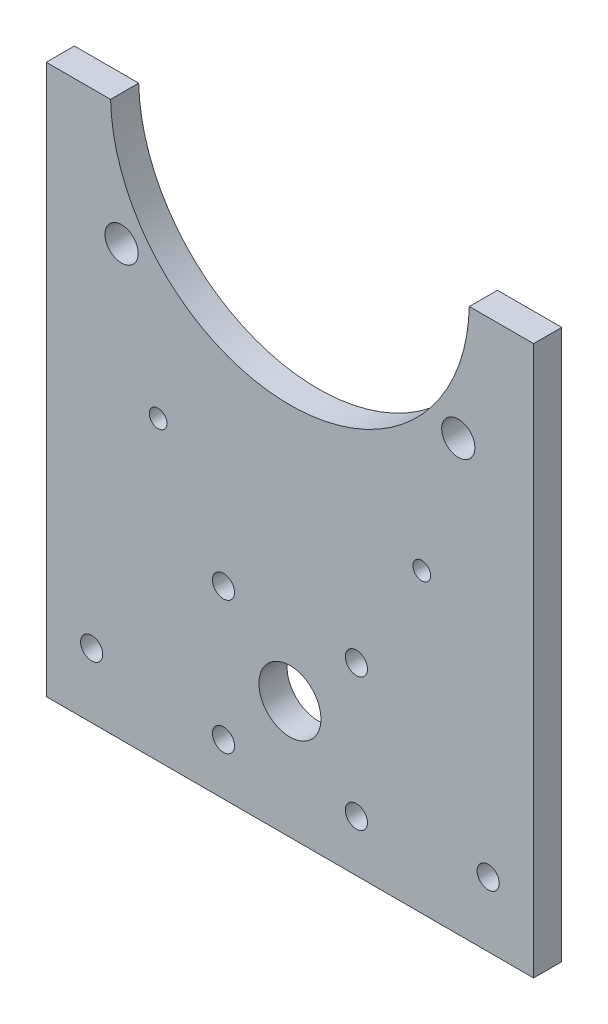
ISO-10303-21;
HEADER;
FILE_DESCRIPTION(('STEP AP214'),'2;1');
FILE_NAME('part.step','',(''),(''),'','','');
FILE_SCHEMA(('AUTOMOTIVE_DESIGN { 1 0 10303 214 1 1 1 1 }'));
ENDSEC;
DATA;
#1=APPLICATION_CONTEXT('core data for automotive mechanical design processes');
#2=APPLICATION_PROTOCOL_DEFINITION('international standard','automotive_design',2000,#1);
#3=PRODUCT_CONTEXT('',#1,'mechanical');
#4=PRODUCT('Part','Part','',(#3));
#5=PRODUCT_RELATED_PRODUCT_CATEGORY('part','',(#4));
#6=PRODUCT_DEFINITION_FORMATION('','',#4);
#7=PRODUCT_DEFINITION_CONTEXT('part definition',#1,'design');
#8=PRODUCT_DEFINITION('design','',#6,#7);
#9=PRODUCT_DEFINITION_SHAPE('','',#8);
#10=(LENGTH_UNIT() NAMED_UNIT(*) SI_UNIT(.MILLI.,.METRE.));
#11=(NAMED_UNIT(*) PLANE_ANGLE_UNIT() SI_UNIT($,.RADIAN.));
#12=(NAMED_UNIT(*) SI_UNIT($,.STERADIAN.) SOLID_ANGLE_UNIT());
#13=UNCERTAINTY_MEASURE_WITH_UNIT(LENGTH_MEASURE(1.E-05),#10,'distance_accuracy_value','');
#14=(GEOMETRIC_REPRESENTATION_CONTEXT(3) GLOBAL_UNCERTAINTY_ASSIGNED_CONTEXT((#13)) GLOBAL_UNIT_ASSIGNED_CONTEXT((#10,
#11,#12)) REPRESENTATION_CONTEXT('',''));
#15=CARTESIAN_POINT('',(0.,0.,0.));
#16=DIRECTION('',(0.,0.,1.));
#17=DIRECTION('',(1.,0.,0.));
#18=AXIS2_PLACEMENT_3D('',#15,#16,#17);
#19=CARTESIAN_POINT('',(-55.,125.,6.35));
#20=DIRECTION('',(0.,0.,1.));
#21=DIRECTION('',(1.,0.,0.));
#22=AXIS2_PLACEMENT_3D('',#19,#20,#21);
#23=PLANE('',#22);
#24=CARTESIAN_POINT('',(-40.,41.6010141988433,6.35));
#25=DIRECTION('',(0.,0.,1.));
#26=DIRECTION('',(1.,0.,0.));
#27=AXIS2_PLACEMENT_3D('',#24,#25,#26);
#28=CIRCLE('',#27,2.5);
#29=CARTESIAN_POINT('',(-37.5,41.6010141988433,6.35));
#30=VERTEX_POINT('',#29);
#31=EDGE_CURVE('E288',#30,#30,#28,.T.);
#32=ORIENTED_EDGE('',*,*,#31,.F.);
#33=EDGE_LOOP('',(#32));
#34=FACE_BOUND('',#33,.T.);
#35=CARTESIAN_POINT('',(-70.,41.6010141988433,6.35));
#36=DIRECTION('',(0.,0.,1.));
#37=DIRECTION('',(1.,0.,0.));
#38=AXIS2_PLACEMENT_3D('',#35,#36,#37);
#39=CIRCLE('',#38,2.50000000000001);
#40=CARTESIAN_POINT('',(-67.5,41.6010141988433,6.35));
#41=VERTEX_POINT('',#40);
#42=EDGE_CURVE('E283',#41,#41,#39,.T.);
#43=ORIENTED_EDGE('',*,*,#42,.F.);
#44=EDGE_LOOP('',(#43));
#45=FACE_BOUND('',#44,.T.);
#46=CARTESIAN_POINT('',(-70.,11.6010141988433,6.35));
#47=DIRECTION('',(0.,0.,1.));
#48=DIRECTION('',(1.,0.,0.));
#49=AXIS2_PLACEMENT_3D('',#46,#47,#48);
#50=CIRCLE('',#49,2.5);
#51=CARTESIAN_POINT('',(-67.5,11.6010141988433,6.35));
#52=VERTEX_POINT('',#51);
#53=EDGE_CURVE('E279',#52,#52,#50,.T.);
#54=ORIENTED_EDGE('',*,*,#53,.F.);
#55=EDGE_LOOP('',(#54));
#56=FACE_BOUND('',#55,.T.);
#57=CARTESIAN_POINT('',(-40.,11.6010141988433,6.35));
#58=DIRECTION('',(0.,0.,1.));
#59=DIRECTION('',(1.,0.,0.));
#60=AXIS2_PLACEMENT_3D('',#57,#58,#59);
#61=CIRCLE('',#60,2.5);
#62=CARTESIAN_POINT('',(-37.5,11.6010141988433,6.35));
#63=VERTEX_POINT('',#62);
#64=EDGE_CURVE('E272',#63,#63,#61,.T.);
#65=ORIENTED_EDGE('',*,*,#64,.F.);
#66=EDGE_LOOP('',(#65));
#67=FACE_BOUND('',#66,.T.);
#68=CARTESIAN_POINT('',(-55.,26.6010141988433,6.35));
#69=DIRECTION('',(0.,0.,1.));
#70=DIRECTION('',(1.,0.,0.));
#71=AXIS2_PLACEMENT_3D('',#68,#69,#70);
#72=CIRCLE('',#71,7.);
#73=CARTESIAN_POINT('',(-48.,26.6010141988433,6.35));
#74=VERTEX_POINT('',#73);
#75=EDGE_CURVE('E144',#74,#74,#72,.T.);
#76=ORIENTED_EDGE('',*,*,#75,.F.);
#77=EDGE_LOOP('',(#76));
#78=FACE_BOUND('',#77,.T.);
#79=CARTESIAN_POINT('',(-99.75,14.6010141988433,6.35));
#80=DIRECTION('',(0.,0.,1.));
#81=DIRECTION('',(1.,0.,0.));
#82=AXIS2_PLACEMENT_3D('',#79,#80,#81);
#83=CIRCLE('',#82,2.5);
#84=CARTESIAN_POINT('',(-97.25,14.6010141988433,6.35));
#85=VERTEX_POINT('',#84);
#86=EDGE_CURVE('E167',#85,#85,#83,.T.);
#87=ORIENTED_EDGE('',*,*,#86,.F.);
#88=EDGE_LOOP('',(#87));
#89=FACE_BOUND('',#88,.T.);
#90=CARTESIAN_POINT('',(-17.,97.,6.35));
#91=DIRECTION('',(0.,0.,1.));
#92=DIRECTION('',(-1.,0.,0.));
#93=AXIS2_PLACEMENT_3D('',#90,#91,#92);
#94=CIRCLE('',#93,3.75000000000001);
#95=CARTESIAN_POINT('',(-20.75,97.,6.35));
#96=VERTEX_POINT('',#95);
#97=EDGE_CURVE('E179',#96,#96,#94,.T.);
#98=ORIENTED_EDGE('',*,*,#97,.F.);
#99=EDGE_LOOP('',(#98));
#100=FACE_BOUND('',#99,.T.);
#101=CARTESIAN_POINT('',(-25.25,67.,6.35));
#102=DIRECTION('',(0.,0.,1.));
#103=DIRECTION('',(-1.,0.,0.));
#104=AXIS2_PLACEMENT_3D('',#101,#102,#103);
#105=CIRCLE('',#104,2.);
#106=CARTESIAN_POINT('',(-27.25,67.,6.35));
#107=VERTEX_POINT('',#106);
#108=EDGE_CURVE('E127',#107,#107,#105,.T.);
#109=ORIENTED_EDGE('',*,*,#108,.F.);
#110=EDGE_LOOP('',(#109));
#111=FACE_BOUND('',#110,.T.);
#112=DIRECTION('',(0.,1.,0.));
#113=VECTOR('',#112,1.);
#114=CARTESIAN_POINT('',(0.,0.,6.35));
#115=LINE('',#114,#113);
#116=CARTESIAN_POINT('',(0.,0.,6.35));
#117=VERTEX_POINT('',#116);
#118=CARTESIAN_POINT('',(0.,124.,6.35));
#119=VERTEX_POINT('',#118);
#120=EDGE_CURVE('E134',#117,#119,#115,.T.);
#121=ORIENTED_EDGE('',*,*,#120,.T.);
#122=DIRECTION('',(-1.,0.,0.));
#123=VECTOR('',#122,1.);
#124=CARTESIAN_POINT('',(0.,124.,6.35));
#125=LINE('',#124,#123);
#126=CARTESIAN_POINT('',(-14.5123475612626,124.,6.35));
#127=VERTEX_POINT('',#126);
#128=EDGE_CURVE('E92',#119,#127,#125,.T.);
#129=ORIENTED_EDGE('',*,*,#128,.T.);
#130=CARTESIAN_POINT('',(-55.,125.,6.35));
#131=DIRECTION('',(0.,0.,-1.));
#132=DIRECTION('',(1.,0.,0.));
#133=AXIS2_PLACEMENT_3D('',#130,#131,#132);
#134=CIRCLE('',#133,40.5);
#135=CARTESIAN_POINT('',(-95.4876524387374,124.,6.35));
#136=VERTEX_POINT('',#135);
#137=EDGE_CURVE('E105',#127,#136,#134,.T.);
#138=ORIENTED_EDGE('',*,*,#137,.T.);
#139=DIRECTION('',(-1.,0.,0.));
#140=VECTOR('',#139,1.);
#141=CARTESIAN_POINT('',(-110.,124.,6.35));
#142=LINE('',#141,#140);
#143=CARTESIAN_POINT('',(-110.,124.,6.35));
#144=VERTEX_POINT('',#143);
#145=EDGE_CURVE('E99',#136,#144,#142,.T.);
#146=ORIENTED_EDGE('',*,*,#145,.T.);
#147=DIRECTION('',(0.,-1.,0.));
#148=VECTOR('',#147,1.);
#149=CARTESIAN_POINT('',(-110.,0.,6.35));
#150=LINE('',#149,#148);
#151=CARTESIAN_POINT('',(-110.,0.,6.35));
#152=VERTEX_POINT('',#151);
#153=EDGE_CURVE('E103',#144,#152,#150,.T.);
#154=ORIENTED_EDGE('',*,*,#153,.T.);
#155=DIRECTION('',(1.,0.,0.));
#156=VECTOR('',#155,1.);
#157=CARTESIAN_POINT('',(0.,0.,6.35));
#158=LINE('',#157,#156);
#159=EDGE_CURVE('E55',#152,#117,#158,.T.);
#160=ORIENTED_EDGE('',*,*,#159,.T.);
#161=EDGE_LOOP('',(#121,#129,#138,#146,#154,#160));
#162=FACE_BOUND('',#161,.T.);
#163=CARTESIAN_POINT('',(-93.,97.,6.35));
#164=DIRECTION('',(0.,0.,1.));
#165=DIRECTION('',(1.,0.,0.));
#166=AXIS2_PLACEMENT_3D('',#163,#164,#165);
#167=CIRCLE('',#166,3.75000000000001);
#168=CARTESIAN_POINT('',(-89.25,97.,6.35));
#169=VERTEX_POINT('',#168);
#170=EDGE_CURVE('E185',#169,#169,#167,.T.);
#171=ORIENTED_EDGE('',*,*,#170,.F.);
#172=EDGE_LOOP('',(#171));
#173=FACE_BOUND('',#172,.T.);
#174=CARTESIAN_POINT('',(-84.75,67.,6.35));
#175=DIRECTION('',(0.,0.,1.));
#176=DIRECTION('',(1.,0.,0.));
#177=AXIS2_PLACEMENT_3D('',#174,#175,#176);
#178=CIRCLE('',#177,2.);
#179=CARTESIAN_POINT('',(-82.75,67.,6.35));
#180=VERTEX_POINT('',#179);
#181=EDGE_CURVE('E173',#180,#180,#178,.T.);
#182=ORIENTED_EDGE('',*,*,#181,.F.);
#183=EDGE_LOOP('',(#182));
#184=FACE_BOUND('',#183,.T.);
#185=CARTESIAN_POINT('',(-10.25,14.6010141988433,6.35));
#186=DIRECTION('',(0.,0.,1.));
#187=DIRECTION('',(1.,0.,0.));
#188=AXIS2_PLACEMENT_3D('',#185,#186,#187);
#189=CIRCLE('',#188,2.5);
#190=CARTESIAN_POINT('',(-7.74999999999999,14.6010141988433,6.35));
#191=VERTEX_POINT('',#190);
#192=EDGE_CURVE('E158',#191,#191,#189,.T.);
#193=ORIENTED_EDGE('',*,*,#192,.F.);
#194=EDGE_LOOP('',(#193));
#195=FACE_BOUND('',#194,.T.);
#196=ADVANCED_FACE('F36',(#34,#45,#56,#67,#78,#89,#100,#111,#162,#173,#184,#195),#23,.T.);
#197=CARTESIAN_POINT('',(-55.,125.,0.));
#198=DIRECTION('',(0.,0.,1.));
#199=DIRECTION('',(1.,0.,0.));
#200=AXIS2_PLACEMENT_3D('',#197,#198,#199);
#201=PLANE('',#200);
#202=CARTESIAN_POINT('',(-40.,41.6010141988433,0.));
#203=DIRECTION('',(0.,0.,1.));
#204=DIRECTION('',(1.,0.,0.));
#205=AXIS2_PLACEMENT_3D('',#202,#203,#204);
#206=CIRCLE('',#205,2.5);
#207=CARTESIAN_POINT('',(-37.5,41.6010141988433,0.));
#208=VERTEX_POINT('',#207);
#209=EDGE_CURVE('E40',#208,#208,#206,.T.);
#210=ORIENTED_EDGE('',*,*,#209,.T.);
#211=EDGE_LOOP('',(#210));
#212=FACE_BOUND('',#211,.T.);
#213=CARTESIAN_POINT('',(-70.,41.6010141988433,0.));
#214=DIRECTION('',(0.,0.,1.));
#215=DIRECTION('',(1.,0.,0.));
#216=AXIS2_PLACEMENT_3D('',#213,#214,#215);
#217=CIRCLE('',#216,2.50000000000001);
#218=CARTESIAN_POINT('',(-67.5,41.6010141988433,0.));
#219=VERTEX_POINT('',#218);
#220=EDGE_CURVE('E149',#219,#219,#217,.T.);
#221=ORIENTED_EDGE('',*,*,#220,.T.);
#222=EDGE_LOOP('',(#221));
#223=FACE_BOUND('',#222,.T.);
#224=CARTESIAN_POINT('',(-70.,11.6010141988433,0.));
#225=DIRECTION('',(0.,0.,1.));
#226=DIRECTION('',(1.,0.,0.));
#227=AXIS2_PLACEMENT_3D('',#224,#225,#226);
#228=CIRCLE('',#227,2.5);
#229=CARTESIAN_POINT('',(-67.5,11.6010141988433,0.));
#230=VERTEX_POINT('',#229);
#231=EDGE_CURVE('E147',#230,#230,#228,.T.);
#232=ORIENTED_EDGE('',*,*,#231,.T.);
#233=EDGE_LOOP('',(#232));
#234=FACE_BOUND('',#233,.T.);
#235=CARTESIAN_POINT('',(-40.,11.6010141988433,0.));
#236=DIRECTION('',(0.,0.,1.));
#237=DIRECTION('',(1.,0.,0.));
#238=AXIS2_PLACEMENT_3D('',#235,#236,#237);
#239=CIRCLE('',#238,2.5);
#240=CARTESIAN_POINT('',(-37.5,11.6010141988433,0.));
#241=VERTEX_POINT('',#240);
#242=EDGE_CURVE('E143',#241,#241,#239,.T.);
#243=ORIENTED_EDGE('',*,*,#242,.T.);
#244=EDGE_LOOP('',(#243));
#245=FACE_BOUND('',#244,.T.);
#246=CARTESIAN_POINT('',(-55.,26.6010141988433,0.));
#247=DIRECTION('',(0.,0.,1.));
#248=DIRECTION('',(1.,0.,0.));
#249=AXIS2_PLACEMENT_3D('',#246,#247,#248);
#250=CIRCLE('',#249,7.);
#251=CARTESIAN_POINT('',(-48.,26.6010141988433,0.));
#252=VERTEX_POINT('',#251);
#253=EDGE_CURVE('E140',#252,#252,#250,.T.);
#254=ORIENTED_EDGE('',*,*,#253,.T.);
#255=EDGE_LOOP('',(#254));
#256=FACE_BOUND('',#255,.T.);
#257=DIRECTION('',(0.,1.,0.));
#258=VECTOR('',#257,1.);
#259=CARTESIAN_POINT('',(0.,0.,0.));
#260=LINE('',#259,#258);
#261=CARTESIAN_POINT('',(0.,0.,0.));
#262=VERTEX_POINT('',#261);
#263=CARTESIAN_POINT('',(0.,124.,0.));
#264=VERTEX_POINT('',#263);
#265=EDGE_CURVE('E123',#262,#264,#260,.T.);
#266=ORIENTED_EDGE('',*,*,#265,.F.);
#267=DIRECTION('',(1.,0.,0.));
#268=VECTOR('',#267,1.);
#269=CARTESIAN_POINT('',(0.,0.,0.));
#270=LINE('',#269,#268);
#271=CARTESIAN_POINT('',(-110.,0.,0.));
#272=VERTEX_POINT('',#271);
#273=EDGE_CURVE('E84',#272,#262,#270,.T.);
#274=ORIENTED_EDGE('',*,*,#273,.F.);
#275=DIRECTION('',(0.,-1.,0.));
#276=VECTOR('',#275,1.);
#277=CARTESIAN_POINT('',(-110.,0.,0.));
#278=LINE('',#277,#276);
#279=CARTESIAN_POINT('',(-110.,124.,0.));
#280=VERTEX_POINT('',#279);
#281=EDGE_CURVE('E78',#280,#272,#278,.T.);
#282=ORIENTED_EDGE('',*,*,#281,.F.);
#283=DIRECTION('',(-1.,0.,0.));
#284=VECTOR('',#283,1.);
#285=CARTESIAN_POINT('',(-110.,124.,0.));
#286=LINE('',#285,#284);
#287=CARTESIAN_POINT('',(-95.4876524387374,124.,0.));
#288=VERTEX_POINT('',#287);
#289=EDGE_CURVE('E113',#288,#280,#286,.T.);
#290=ORIENTED_EDGE('',*,*,#289,.F.);
#291=CARTESIAN_POINT('',(-55.,125.,0.));
#292=DIRECTION('',(0.,0.,-1.));
#293=DIRECTION('',(1.,0.,0.));
#294=AXIS2_PLACEMENT_3D('',#291,#292,#293);
#295=CIRCLE('',#294,40.5);
#296=CARTESIAN_POINT('',(-14.5123475612626,124.,0.));
#297=VERTEX_POINT('',#296);
#298=EDGE_CURVE('E129',#297,#288,#295,.T.);
#299=ORIENTED_EDGE('',*,*,#298,.F.);
#300=DIRECTION('',(-1.,0.,0.));
#301=VECTOR('',#300,1.);
#302=CARTESIAN_POINT('',(0.,124.,0.));
#303=LINE('',#302,#301);
#304=EDGE_CURVE('E126',#264,#297,#303,.T.);
#305=ORIENTED_EDGE('',*,*,#304,.F.);
#306=EDGE_LOOP('',(#266,#274,#282,#290,#299,#305));
#307=FACE_BOUND('',#306,.T.);
#308=CARTESIAN_POINT('',(-25.25,67.,0.));
#309=DIRECTION('',(0.,0.,1.));
#310=DIRECTION('',(-1.,0.,0.));
#311=AXIS2_PLACEMENT_3D('',#308,#309,#310);
#312=CIRCLE('',#311,2.);
#313=CARTESIAN_POINT('',(-27.25,67.,0.));
#314=VERTEX_POINT('',#313);
#315=EDGE_CURVE('E188',#314,#314,#312,.T.);
#316=ORIENTED_EDGE('',*,*,#315,.T.);
#317=EDGE_LOOP('',(#316));
#318=FACE_BOUND('',#317,.T.);
#319=CARTESIAN_POINT('',(-93.,97.,0.));
#320=DIRECTION('',(0.,0.,1.));
#321=DIRECTION('',(1.,0.,0.));
#322=AXIS2_PLACEMENT_3D('',#319,#320,#321);
#323=CIRCLE('',#322,3.75000000000001);
#324=CARTESIAN_POINT('',(-89.25,97.,0.));
#325=VERTEX_POINT('',#324);
#326=EDGE_CURVE('E182',#325,#325,#323,.T.);
#327=ORIENTED_EDGE('',*,*,#326,.T.);
#328=EDGE_LOOP('',(#327));
#329=FACE_BOUND('',#328,.T.);
#330=CARTESIAN_POINT('',(-17.,97.,0.));
#331=DIRECTION('',(0.,0.,1.));
#332=DIRECTION('',(-1.,0.,0.));
#333=AXIS2_PLACEMENT_3D('',#330,#331,#332);
#334=CIRCLE('',#333,3.75000000000001);
#335=CARTESIAN_POINT('',(-20.75,97.,0.));
#336=VERTEX_POINT('',#335);
#337=EDGE_CURVE('E176',#336,#336,#334,.T.);
#338=ORIENTED_EDGE('',*,*,#337,.T.);
#339=EDGE_LOOP('',(#338));
#340=FACE_BOUND('',#339,.T.);
#341=CARTESIAN_POINT('',(-84.75,67.,0.));
#342=DIRECTION('',(0.,0.,1.));
#343=DIRECTION('',(1.,0.,0.));
#344=AXIS2_PLACEMENT_3D('',#341,#342,#343);
#345=CIRCLE('',#344,2.);
#346=CARTESIAN_POINT('',(-82.75,67.,0.));
#347=VERTEX_POINT('',#346);
#348=EDGE_CURVE('E170',#347,#347,#345,.T.);
#349=ORIENTED_EDGE('',*,*,#348,.T.);
#350=EDGE_LOOP('',(#349));
#351=FACE_BOUND('',#350,.T.);
#352=CARTESIAN_POINT('',(-99.75,14.6010141988433,0.));
#353=DIRECTION('',(0.,0.,1.));
#354=DIRECTION('',(1.,0.,0.));
#355=AXIS2_PLACEMENT_3D('',#352,#353,#354);
#356=CIRCLE('',#355,2.5);
#357=CARTESIAN_POINT('',(-97.25,14.6010141988433,0.));
#358=VERTEX_POINT('',#357);
#359=EDGE_CURVE('E163',#358,#358,#356,.T.);
#360=ORIENTED_EDGE('',*,*,#359,.T.);
#361=EDGE_LOOP('',(#360));
#362=FACE_BOUND('',#361,.T.);
#363=CARTESIAN_POINT('',(-10.25,14.6010141988433,0.));
#364=DIRECTION('',(0.,0.,1.));
#365=DIRECTION('',(1.,0.,0.));
#366=AXIS2_PLACEMENT_3D('',#363,#364,#365);
#367=CIRCLE('',#366,2.5);
#368=CARTESIAN_POINT('',(-7.74999999999999,14.6010141988433,0.));
#369=VERTEX_POINT('',#368);
#370=EDGE_CURVE('E154',#369,#369,#367,.T.);
#371=ORIENTED_EDGE('',*,*,#370,.T.);
#372=EDGE_LOOP('',(#371));
#373=FACE_BOUND('',#372,.T.);
#374=ADVANCED_FACE('F204',(#212,#223,#234,#245,#256,#307,#318,#329,#340,#351,#362,#373),#201,.F.);
#375=CARTESIAN_POINT('',(0.,0.,6.35));
#376=DIRECTION('',(-1.,0.,0.));
#377=DIRECTION('',(0.,0.,1.));
#378=AXIS2_PLACEMENT_3D('',#375,#376,#377);
#379=PLANE('',#378);
#380=ORIENTED_EDGE('',*,*,#265,.T.);
#381=DIRECTION('',(0.,0.,-1.));
#382=VECTOR('',#381,1.);
#383=CARTESIAN_POINT('',(0.,124.,6.35));
#384=LINE('',#383,#382);
#385=EDGE_CURVE('E11',#119,#264,#384,.T.);
#386=ORIENTED_EDGE('',*,*,#385,.F.);
#387=ORIENTED_EDGE('',*,*,#120,.F.);
#388=DIRECTION('',(0.,0.,-1.));
#389=VECTOR('',#388,1.);
#390=CARTESIAN_POINT('',(0.,0.,6.35));
#391=LINE('',#390,#389);
#392=EDGE_CURVE('E119',#117,#262,#391,.T.);
#393=ORIENTED_EDGE('',*,*,#392,.T.);
#394=EDGE_LOOP('',(#380,#386,#387,#393));
#395=FACE_BOUND('',#394,.T.);
#396=ADVANCED_FACE('F38',(#395),#379,.F.);
#397=CARTESIAN_POINT('',(0.,124.,6.35));
#398=DIRECTION('',(0.,-1.,0.));
#399=DIRECTION('',(0.,0.,-1.));
#400=AXIS2_PLACEMENT_3D('',#397,#398,#399);
#401=PLANE('',#400);
#402=ORIENTED_EDGE('',*,*,#304,.T.);
#403=DIRECTION('',(0.,0.,-1.));
#404=VECTOR('',#403,1.);
#405=CARTESIAN_POINT('',(-14.5123475612626,124.,6.35));
#406=LINE('',#405,#404);
#407=EDGE_CURVE('E46',#127,#297,#406,.T.);
#408=ORIENTED_EDGE('',*,*,#407,.F.);
#409=ORIENTED_EDGE('',*,*,#128,.F.);
#410=ORIENTED_EDGE('',*,*,#385,.T.);
#411=EDGE_LOOP('',(#402,#408,#409,#410));
#412=FACE_BOUND('',#411,.T.);
#413=ADVANCED_FACE('F198',(#412),#401,.F.);
#414=CARTESIAN_POINT('',(-55.,125.,6.35));
#415=DIRECTION('',(0.,0.,-1.));
#416=DIRECTION('',(-1.,0.,0.));
#417=AXIS2_PLACEMENT_3D('',#414,#415,#416);
#418=CYLINDRICAL_SURFACE('',#417,40.5);
#419=ORIENTED_EDGE('',*,*,#298,.T.);
#420=DIRECTION('',(0.,0.,-1.));
#421=VECTOR('',#420,1.);
#422=CARTESIAN_POINT('',(-95.4876524387374,124.,6.35));
#423=LINE('',#422,#421);
#424=EDGE_CURVE('E114',#136,#288,#423,.T.);
#425=ORIENTED_EDGE('',*,*,#424,.F.);
#426=ORIENTED_EDGE('',*,*,#137,.F.);
#427=ORIENTED_EDGE('',*,*,#407,.T.);
#428=EDGE_LOOP('',(#419,#425,#426,#427));
#429=FACE_BOUND('',#428,.T.);
#430=ADVANCED_FACE('F201',(#429),#418,.F.);
#431=CARTESIAN_POINT('',(-110.,124.,6.35));
#432=DIRECTION('',(0.,-1.,0.));
#433=DIRECTION('',(0.,0.,-1.));
#434=AXIS2_PLACEMENT_3D('',#431,#432,#433);
#435=PLANE('',#434);
#436=ORIENTED_EDGE('',*,*,#289,.T.);
#437=DIRECTION('',(0.,0.,-1.));
#438=VECTOR('',#437,1.);
#439=CARTESIAN_POINT('',(-110.,124.,6.35));
#440=LINE('',#439,#438);
#441=EDGE_CURVE('E110',#144,#280,#440,.T.);
#442=ORIENTED_EDGE('',*,*,#441,.F.);
#443=ORIENTED_EDGE('',*,*,#145,.F.);
#444=ORIENTED_EDGE('',*,*,#424,.T.);
#445=EDGE_LOOP('',(#436,#442,#443,#444));
#446=FACE_BOUND('',#445,.T.);
#447=ADVANCED_FACE('F111',(#446),#435,.F.);
#448=CARTESIAN_POINT('',(-110.,0.,6.35));
#449=DIRECTION('',(1.,0.,0.));
#450=DIRECTION('',(0.,0.,-1.));
#451=AXIS2_PLACEMENT_3D('',#448,#449,#450);
#452=PLANE('',#451);
#453=ORIENTED_EDGE('',*,*,#281,.T.);
#454=DIRECTION('',(0.,0.,-1.));
#455=VECTOR('',#454,1.);
#456=CARTESIAN_POINT('',(-110.,0.,6.35));
#457=LINE('',#456,#455);
#458=EDGE_CURVE('E115',#152,#272,#457,.T.);
#459=ORIENTED_EDGE('',*,*,#458,.F.);
#460=ORIENTED_EDGE('',*,*,#153,.F.);
#461=ORIENTED_EDGE('',*,*,#441,.T.);
#462=EDGE_LOOP('',(#453,#459,#460,#461));
#463=FACE_BOUND('',#462,.T.);
#464=ADVANCED_FACE('F117',(#463),#452,.F.);
#465=CARTESIAN_POINT('',(0.,0.,6.35));
#466=DIRECTION('',(0.,1.,0.));
#467=DIRECTION('',(0.,0.,1.));
#468=AXIS2_PLACEMENT_3D('',#465,#466,#467);
#469=PLANE('',#468);
#470=ORIENTED_EDGE('',*,*,#273,.T.);
#471=ORIENTED_EDGE('',*,*,#392,.F.);
#472=ORIENTED_EDGE('',*,*,#159,.F.);
#473=ORIENTED_EDGE('',*,*,#458,.T.);
#474=EDGE_LOOP('',(#470,#471,#472,#473));
#475=FACE_BOUND('',#474,.T.);
#476=ADVANCED_FACE('F207',(#475),#469,.F.);
#477=CARTESIAN_POINT('',(-25.25,67.,6.35));
#478=DIRECTION('',(0.,0.,-1.));
#479=DIRECTION('',(-1.,0.,0.));
#480=AXIS2_PLACEMENT_3D('',#477,#478,#479);
#481=CYLINDRICAL_SURFACE('',#480,2.);
#482=ORIENTED_EDGE('',*,*,#108,.T.);
#483=EDGE_LOOP('',(#482));
#484=FACE_BOUND('',#483,.T.);
#485=ORIENTED_EDGE('',*,*,#315,.F.);
#486=EDGE_LOOP('',(#485));
#487=FACE_BOUND('',#486,.T.);
#488=ADVANCED_FACE('F209',(#484,#487),#481,.F.);
#489=CARTESIAN_POINT('',(-93.,97.,6.35));
#490=DIRECTION('',(0.,0.,-1.));
#491=DIRECTION('',(-1.,0.,0.));
#492=AXIS2_PLACEMENT_3D('',#489,#490,#491);
#493=CYLINDRICAL_SURFACE('',#492,3.75000000000001);
#494=ORIENTED_EDGE('',*,*,#170,.T.);
#495=EDGE_LOOP('',(#494));
#496=FACE_BOUND('',#495,.T.);
#497=ORIENTED_EDGE('',*,*,#326,.F.);
#498=EDGE_LOOP('',(#497));
#499=FACE_BOUND('',#498,.T.);
#500=ADVANCED_FACE('F215',(#496,#499),#493,.F.);
#501=CARTESIAN_POINT('',(-17.,97.,6.35));
#502=DIRECTION('',(0.,0.,-1.));
#503=DIRECTION('',(-1.,0.,0.));
#504=AXIS2_PLACEMENT_3D('',#501,#502,#503);
#505=CYLINDRICAL_SURFACE('',#504,3.75000000000001);
#506=ORIENTED_EDGE('',*,*,#97,.T.);
#507=EDGE_LOOP('',(#506));
#508=FACE_BOUND('',#507,.T.);
#509=ORIENTED_EDGE('',*,*,#337,.F.);
#510=EDGE_LOOP('',(#509));
#511=FACE_BOUND('',#510,.T.);
#512=ADVANCED_FACE('F231',(#508,#511),#505,.F.);
#513=CARTESIAN_POINT('',(-84.75,67.,6.35));
#514=DIRECTION('',(0.,0.,-1.));
#515=DIRECTION('',(-1.,0.,0.));
#516=AXIS2_PLACEMENT_3D('',#513,#514,#515);
#517=CYLINDRICAL_SURFACE('',#516,2.);
#518=ORIENTED_EDGE('',*,*,#181,.T.);
#519=EDGE_LOOP('',(#518));
#520=FACE_BOUND('',#519,.T.);
#521=ORIENTED_EDGE('',*,*,#348,.F.);
#522=EDGE_LOOP('',(#521));
#523=FACE_BOUND('',#522,.T.);
#524=ADVANCED_FACE('F235',(#520,#523),#517,.F.);
#525=CARTESIAN_POINT('',(-99.75,14.6010141988433,6.35));
#526=DIRECTION('',(0.,0.,-1.));
#527=DIRECTION('',(-1.,0.,0.));
#528=AXIS2_PLACEMENT_3D('',#525,#526,#527);
#529=CYLINDRICAL_SURFACE('',#528,2.5);
#530=ORIENTED_EDGE('',*,*,#86,.T.);
#531=EDGE_LOOP('',(#530));
#532=FACE_BOUND('',#531,.T.);
#533=ORIENTED_EDGE('',*,*,#359,.F.);
#534=EDGE_LOOP('',(#533));
#535=FACE_BOUND('',#534,.T.);
#536=ADVANCED_FACE('F239',(#532,#535),#529,.F.);
#537=CARTESIAN_POINT('',(-10.25,14.6010141988433,6.35));
#538=DIRECTION('',(0.,0.,-1.));
#539=DIRECTION('',(-1.,0.,0.));
#540=AXIS2_PLACEMENT_3D('',#537,#538,#539);
#541=CYLINDRICAL_SURFACE('',#540,2.5);
#542=ORIENTED_EDGE('',*,*,#192,.T.);
#543=EDGE_LOOP('',(#542));
#544=FACE_BOUND('',#543,.T.);
#545=ORIENTED_EDGE('',*,*,#370,.F.);
#546=EDGE_LOOP('',(#545));
#547=FACE_BOUND('',#546,.T.);
#548=ADVANCED_FACE('F243',(#544,#547),#541,.F.);
#549=CARTESIAN_POINT('',(-55.,26.6010141988433,-3.65));
#550=DIRECTION('',(0.,0.,1.));
#551=DIRECTION('',(1.,0.,0.));
#552=AXIS2_PLACEMENT_3D('',#549,#550,#551);
#553=CYLINDRICAL_SURFACE('',#552,7.);
#554=ORIENTED_EDGE('',*,*,#75,.T.);
#555=EDGE_LOOP('',(#554));
#556=FACE_BOUND('',#555,.T.);
#557=ORIENTED_EDGE('',*,*,#253,.F.);
#558=EDGE_LOOP('',(#557));
#559=FACE_BOUND('',#558,.T.);
#560=ADVANCED_FACE('F247',(#556,#559),#553,.F.);
#561=CARTESIAN_POINT('',(-40.,11.6010141988433,-3.65));
#562=DIRECTION('',(0.,0.,1.));
#563=DIRECTION('',(1.,0.,0.));
#564=AXIS2_PLACEMENT_3D('',#561,#562,#563);
#565=CYLINDRICAL_SURFACE('',#564,2.5);
#566=ORIENTED_EDGE('',*,*,#64,.T.);
#567=EDGE_LOOP('',(#566));
#568=FACE_BOUND('',#567,.T.);
#569=ORIENTED_EDGE('',*,*,#242,.F.);
#570=EDGE_LOOP('',(#569));
#571=FACE_BOUND('',#570,.T.);
#572=ADVANCED_FACE('F251',(#568,#571),#565,.F.);
#573=CARTESIAN_POINT('',(-70.,11.6010141988433,-3.65));
#574=DIRECTION('',(0.,0.,1.));
#575=DIRECTION('',(1.,0.,0.));
#576=AXIS2_PLACEMENT_3D('',#573,#574,#575);
#577=CYLINDRICAL_SURFACE('',#576,2.5);
#578=ORIENTED_EDGE('',*,*,#53,.T.);
#579=EDGE_LOOP('',(#578));
#580=FACE_BOUND('',#579,.T.);
#581=ORIENTED_EDGE('',*,*,#231,.F.);
#582=EDGE_LOOP('',(#581));
#583=FACE_BOUND('',#582,.T.);
#584=ADVANCED_FACE('F260',(#580,#583),#577,.F.);
#585=CARTESIAN_POINT('',(-70.,41.6010141988433,-3.65));
#586=DIRECTION('',(0.,0.,1.));
#587=DIRECTION('',(1.,0.,0.));
#588=AXIS2_PLACEMENT_3D('',#585,#586,#587);
#589=CYLINDRICAL_SURFACE('',#588,2.50000000000001);
#590=ORIENTED_EDGE('',*,*,#42,.T.);
#591=EDGE_LOOP('',(#590));
#592=FACE_BOUND('',#591,.T.);
#593=ORIENTED_EDGE('',*,*,#220,.F.);
#594=EDGE_LOOP('',(#593));
#595=FACE_BOUND('',#594,.T.);
#596=ADVANCED_FACE('F256',(#592,#595),#589,.F.);
#597=CARTESIAN_POINT('',(-40.,41.6010141988433,-3.65));
#598=DIRECTION('',(0.,0.,1.));
#599=DIRECTION('',(1.,0.,0.));
#600=AXIS2_PLACEMENT_3D('',#597,#598,#599);
#601=CYLINDRICAL_SURFACE('',#600,2.5);
#602=ORIENTED_EDGE('',*,*,#31,.T.);
#603=EDGE_LOOP('',(#602));
#604=FACE_BOUND('',#603,.T.);
#605=ORIENTED_EDGE('',*,*,#209,.F.);
#606=EDGE_LOOP('',(#605));
#607=FACE_BOUND('',#606,.T.);
#608=ADVANCED_FACE('F253',(#604,#607),#601,.F.);
#609=CLOSED_SHELL('',(#196,#374,#396,#413,#430,#447,#464,#476,#488,#500,#512,#524,#536,#548,
#560,#572,#584,#596,#608));
#610=MANIFOLD_SOLID_BREP('B2',#609);
#611=ADVANCED_BREP_SHAPE_REPRESENTATION('',(#18,#610),#14);
#612=SHAPE_DEFINITION_REPRESENTATION(#9,#611);
ENDSEC;
END-ISO-10303-21;
